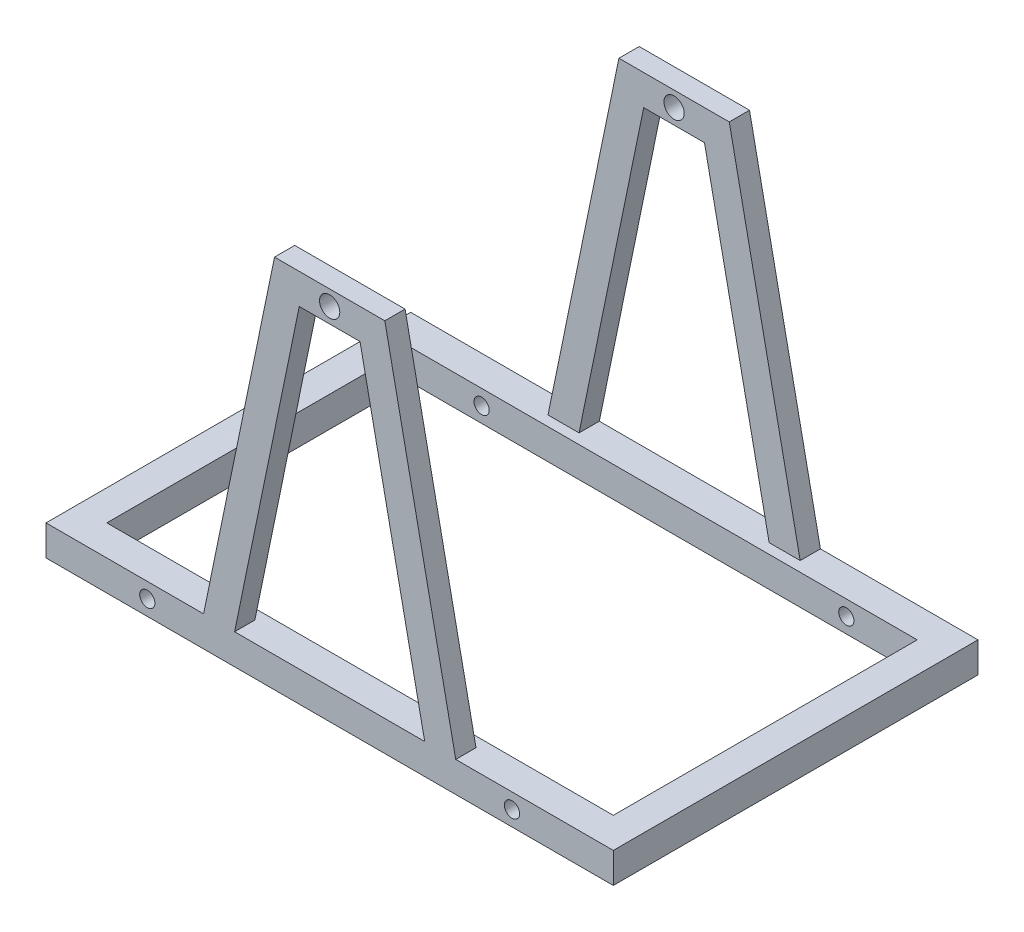
ISO-10303-21;
HEADER;
FILE_DESCRIPTION(('STEP AP214'),'2;1');
FILE_NAME('part.step','',(''),(''),'','','');
FILE_SCHEMA(('AUTOMOTIVE_DESIGN { 1 0 10303 214 1 1 1 1 }'));
ENDSEC;
DATA;
#1=APPLICATION_CONTEXT('core data for automotive mechanical design processes');
#2=APPLICATION_PROTOCOL_DEFINITION('international standard','automotive_design',2000,#1);
#3=PRODUCT_CONTEXT('',#1,'mechanical');
#4=PRODUCT('Part','Part','',(#3));
#5=PRODUCT_RELATED_PRODUCT_CATEGORY('part','',(#4));
#6=PRODUCT_DEFINITION_FORMATION('','',#4);
#7=PRODUCT_DEFINITION_CONTEXT('part definition',#1,'design');
#8=PRODUCT_DEFINITION('design','',#6,#7);
#9=PRODUCT_DEFINITION_SHAPE('','',#8);
#10=(LENGTH_UNIT() NAMED_UNIT(*) SI_UNIT(.MILLI.,.METRE.));
#11=(NAMED_UNIT(*) PLANE_ANGLE_UNIT() SI_UNIT($,.RADIAN.));
#12=(NAMED_UNIT(*) SI_UNIT($,.STERADIAN.) SOLID_ANGLE_UNIT());
#13=UNCERTAINTY_MEASURE_WITH_UNIT(LENGTH_MEASURE(1.E-05),#10,'distance_accuracy_value','');
#14=(GEOMETRIC_REPRESENTATION_CONTEXT(3) GLOBAL_UNCERTAINTY_ASSIGNED_CONTEXT((#13)) GLOBAL_UNIT_ASSIGNED_CONTEXT((#10,
#11,#12)) REPRESENTATION_CONTEXT('',''));
#15=CARTESIAN_POINT('',(0.,0.,0.));
#16=DIRECTION('',(0.,0.,1.));
#17=DIRECTION('',(1.,0.,0.));
#18=AXIS2_PLACEMENT_3D('',#15,#16,#17);
#19=CARTESIAN_POINT('',(0.,30.,0.));
#20=DIRECTION('',(0.,1.,0.));
#21=DIRECTION('',(0.,0.,1.));
#22=AXIS2_PLACEMENT_3D('',#19,#20,#21);
#23=PLANE('',#22);
#24=DIRECTION('',(1.,0.,0.));
#25=VECTOR('',#24,1.);
#26=CARTESIAN_POINT('',(250.,30.,150.));
#27=LINE('',#26,#25);
#28=CARTESIAN_POINT('',(-250.,30.,150.));
#29=VERTEX_POINT('',#28);
#30=CARTESIAN_POINT('',(250.,30.,150.));
#31=VERTEX_POINT('',#30);
#32=EDGE_CURVE('E430',#29,#31,#27,.T.);
#33=ORIENTED_EDGE('',*,*,#32,.F.);
#34=DIRECTION('',(0.,0.,1.));
#35=VECTOR('',#34,1.);
#36=CARTESIAN_POINT('',(-250.,30.,-150.));
#37=LINE('',#36,#35);
#38=CARTESIAN_POINT('',(-250.,30.,-150.));
#39=VERTEX_POINT('',#38);
#40=EDGE_CURVE('E427',#39,#29,#37,.T.);
#41=ORIENTED_EDGE('',*,*,#40,.F.);
#42=DIRECTION('',(-1.,0.,0.));
#43=VECTOR('',#42,1.);
#44=CARTESIAN_POINT('',(250.,30.,-150.));
#45=LINE('',#44,#43);
#46=CARTESIAN_POINT('',(250.,30.,-150.));
#47=VERTEX_POINT('',#46);
#48=EDGE_CURVE('E438',#47,#39,#45,.T.);
#49=ORIENTED_EDGE('',*,*,#48,.F.);
#50=DIRECTION('',(0.,0.,-1.));
#51=VECTOR('',#50,1.);
#52=CARTESIAN_POINT('',(250.,30.,-150.));
#53=LINE('',#52,#51);
#54=EDGE_CURVE('E434',#31,#47,#53,.T.);
#55=ORIENTED_EDGE('',*,*,#54,.F.);
#56=EDGE_LOOP('',(#33,#41,#49,#55));
#57=FACE_BOUND('',#56,.T.);
#58=DIRECTION('',(1.,0.,0.));
#59=VECTOR('',#58,1.);
#60=CARTESIAN_POINT('',(0.,30.,-160.));
#61=LINE('',#60,#59);
#62=CARTESIAN_POINT('',(-124.452744043017,30.,-160.));
#63=VERTEX_POINT('',#62);
#64=CARTESIAN_POINT('',(-93.8235294117647,30.,-160.));
#65=VERTEX_POINT('',#64);
#66=EDGE_CURVE('E91',#63,#65,#61,.T.);
#67=ORIENTED_EDGE('',*,*,#66,.F.);
#68=DIRECTION('',(0.,0.,-1.));
#69=VECTOR('',#68,1.);
#70=CARTESIAN_POINT('',(-124.452744043017,30.,0.));
#71=LINE('',#70,#69);
#72=CARTESIAN_POINT('',(-124.452744043017,30.,-180.));
#73=VERTEX_POINT('',#72);
#74=EDGE_CURVE('E258',#63,#73,#71,.T.);
#75=ORIENTED_EDGE('',*,*,#74,.T.);
#76=DIRECTION('',(-1.,0.,0.));
#77=VECTOR('',#76,1.);
#78=CARTESIAN_POINT('',(0.,30.,-180.));
#79=LINE('',#78,#77);
#80=CARTESIAN_POINT('',(-280.,30.,-180.));
#81=VERTEX_POINT('',#80);
#82=EDGE_CURVE('E483',#73,#81,#79,.T.);
#83=ORIENTED_EDGE('',*,*,#82,.T.);
#84=DIRECTION('',(0.,0.,1.));
#85=VECTOR('',#84,1.);
#86=CARTESIAN_POINT('',(-280.,30.,0.));
#87=LINE('',#86,#85);
#88=CARTESIAN_POINT('',(-280.,30.,180.));
#89=VERTEX_POINT('',#88);
#90=EDGE_CURVE('E470',#81,#89,#87,.T.);
#91=ORIENTED_EDGE('',*,*,#90,.T.);
#92=DIRECTION('',(1.,0.,0.));
#93=VECTOR('',#92,1.);
#94=CARTESIAN_POINT('',(0.,30.,180.));
#95=LINE('',#94,#93);
#96=CARTESIAN_POINT('',(-124.452744043017,30.,180.));
#97=VERTEX_POINT('',#96);
#98=EDGE_CURVE('E476',#89,#97,#95,.T.);
#99=ORIENTED_EDGE('',*,*,#98,.T.);
#100=DIRECTION('',(0.,0.,1.));
#101=VECTOR('',#100,1.);
#102=CARTESIAN_POINT('',(-124.452744043017,30.,0.));
#103=LINE('',#102,#101);
#104=CARTESIAN_POINT('',(-124.452744043017,30.,160.));
#105=VERTEX_POINT('',#104);
#106=EDGE_CURVE('E391',#105,#97,#103,.T.);
#107=ORIENTED_EDGE('',*,*,#106,.F.);
#108=DIRECTION('',(-1.,0.,0.));
#109=VECTOR('',#108,1.);
#110=CARTESIAN_POINT('',(0.,30.,160.));
#111=LINE('',#110,#109);
#112=CARTESIAN_POINT('',(-93.8235294117647,30.,160.));
#113=VERTEX_POINT('',#112);
#114=EDGE_CURVE('E395',#113,#105,#111,.T.);
#115=ORIENTED_EDGE('',*,*,#114,.F.);
#116=DIRECTION('',(0.,0.,1.));
#117=VECTOR('',#116,1.);
#118=CARTESIAN_POINT('',(-93.8235294117647,30.,0.));
#119=LINE('',#118,#117);
#120=CARTESIAN_POINT('',(-93.8235294117647,30.,180.));
#121=VERTEX_POINT('',#120);
#122=EDGE_CURVE('E369',#113,#121,#119,.T.);
#123=ORIENTED_EDGE('',*,*,#122,.T.);
#124=CARTESIAN_POINT('',(93.8235294117647,30.,180.));
#125=VERTEX_POINT('',#124);
#126=EDGE_CURVE('E480',#121,#125,#95,.T.);
#127=ORIENTED_EDGE('',*,*,#126,.T.);
#128=DIRECTION('',(0.,0.,-1.));
#129=VECTOR('',#128,1.);
#130=CARTESIAN_POINT('',(93.8235294117647,30.,0.));
#131=LINE('',#130,#129);
#132=CARTESIAN_POINT('',(93.8235294117647,30.,160.));
#133=VERTEX_POINT('',#132);
#134=EDGE_CURVE('E384',#125,#133,#131,.T.);
#135=ORIENTED_EDGE('',*,*,#134,.T.);
#136=CARTESIAN_POINT('',(124.452744043017,30.,160.));
#137=VERTEX_POINT('',#136);
#138=EDGE_CURVE('E399',#137,#133,#111,.T.);
#139=ORIENTED_EDGE('',*,*,#138,.F.);
#140=DIRECTION('',(0.,0.,-1.));
#141=VECTOR('',#140,1.);
#142=CARTESIAN_POINT('',(124.452744043017,30.,0.));
#143=LINE('',#142,#141);
#144=CARTESIAN_POINT('',(124.452744043017,30.,180.));
#145=VERTEX_POINT('',#144);
#146=EDGE_CURVE('E387',#145,#137,#143,.T.);
#147=ORIENTED_EDGE('',*,*,#146,.F.);
#148=CARTESIAN_POINT('',(280.,30.,180.));
#149=VERTEX_POINT('',#148);
#150=EDGE_CURVE('E474',#145,#149,#95,.T.);
#151=ORIENTED_EDGE('',*,*,#150,.T.);
#152=DIRECTION('',(0.,0.,-1.));
#153=VECTOR('',#152,1.);
#154=CARTESIAN_POINT('',(280.,30.,0.));
#155=LINE('',#154,#153);
#156=CARTESIAN_POINT('',(280.,30.,-180.));
#157=VERTEX_POINT('',#156);
#158=EDGE_CURVE('E479',#149,#157,#155,.T.);
#159=ORIENTED_EDGE('',*,*,#158,.T.);
#160=CARTESIAN_POINT('',(124.452744043017,30.,-180.));
#161=VERTEX_POINT('',#160);
#162=EDGE_CURVE('E484',#157,#161,#79,.T.);
#163=ORIENTED_EDGE('',*,*,#162,.T.);
#164=DIRECTION('',(0.,0.,1.));
#165=VECTOR('',#164,1.);
#166=CARTESIAN_POINT('',(124.452744043017,30.,0.));
#167=LINE('',#166,#165);
#168=CARTESIAN_POINT('',(124.452744043017,30.,-160.));
#169=VERTEX_POINT('',#168);
#170=EDGE_CURVE('E298',#161,#169,#167,.T.);
#171=ORIENTED_EDGE('',*,*,#170,.T.);
#172=CARTESIAN_POINT('',(93.8235294117647,30.,-160.));
#173=VERTEX_POINT('',#172);
#174=EDGE_CURVE('E315',#173,#169,#61,.T.);
#175=ORIENTED_EDGE('',*,*,#174,.F.);
#176=DIRECTION('',(0.,0.,1.));
#177=VECTOR('',#176,1.);
#178=CARTESIAN_POINT('',(93.8235294117647,30.,0.));
#179=LINE('',#178,#177);
#180=CARTESIAN_POINT('',(93.8235294117647,30.,-180.));
#181=VERTEX_POINT('',#180);
#182=EDGE_CURVE('E307',#181,#173,#179,.T.);
#183=ORIENTED_EDGE('',*,*,#182,.F.);
#184=CARTESIAN_POINT('',(-93.8235294117647,30.,-180.));
#185=VERTEX_POINT('',#184);
#186=EDGE_CURVE('E488',#181,#185,#79,.T.);
#187=ORIENTED_EDGE('',*,*,#186,.T.);
#188=DIRECTION('',(0.,0.,-1.));
#189=VECTOR('',#188,1.);
#190=CARTESIAN_POINT('',(-93.8235294117647,30.,0.));
#191=LINE('',#190,#189);
#192=EDGE_CURVE('E87',#65,#185,#191,.T.);
#193=ORIENTED_EDGE('',*,*,#192,.F.);
#194=EDGE_LOOP('',(#67,#75,#83,#91,#99,#107,#115,#123,#127,#135,#139,#147,#151,#159,#163,#171,
#175,#183,#187,#193));
#195=FACE_BOUND('',#194,.T.);
#196=ADVANCED_FACE('F69',(#57,#195),#23,.T.);
#197=CARTESIAN_POINT('',(0.,0.,0.));
#198=DIRECTION('',(0.,1.,0.));
#199=DIRECTION('',(0.,0.,1.));
#200=AXIS2_PLACEMENT_3D('',#197,#198,#199);
#201=PLANE('',#200);
#202=DIRECTION('',(0.,0.,1.));
#203=VECTOR('',#202,1.);
#204=CARTESIAN_POINT('',(-280.,0.,0.));
#205=LINE('',#204,#203);
#206=CARTESIAN_POINT('',(-280.,0.,-180.));
#207=VERTEX_POINT('',#206);
#208=CARTESIAN_POINT('',(-280.,0.,180.));
#209=VERTEX_POINT('',#208);
#210=EDGE_CURVE('E469',#207,#209,#205,.T.);
#211=ORIENTED_EDGE('',*,*,#210,.F.);
#212=DIRECTION('',(-1.,0.,0.));
#213=VECTOR('',#212,1.);
#214=CARTESIAN_POINT('',(0.,0.,-180.));
#215=LINE('',#214,#213);
#216=CARTESIAN_POINT('',(280.,0.,-180.));
#217=VERTEX_POINT('',#216);
#218=EDGE_CURVE('E475',#217,#207,#215,.T.);
#219=ORIENTED_EDGE('',*,*,#218,.F.);
#220=DIRECTION('',(0.,0.,-1.));
#221=VECTOR('',#220,1.);
#222=CARTESIAN_POINT('',(280.,0.,0.));
#223=LINE('',#222,#221);
#224=CARTESIAN_POINT('',(280.,0.,180.));
#225=VERTEX_POINT('',#224);
#226=EDGE_CURVE('E495',#225,#217,#223,.T.);
#227=ORIENTED_EDGE('',*,*,#226,.F.);
#228=DIRECTION('',(1.,0.,0.));
#229=VECTOR('',#228,1.);
#230=CARTESIAN_POINT('',(0.,0.,180.));
#231=LINE('',#230,#229);
#232=EDGE_CURVE('E492',#209,#225,#231,.T.);
#233=ORIENTED_EDGE('',*,*,#232,.F.);
#234=EDGE_LOOP('',(#211,#219,#227,#233));
#235=FACE_BOUND('',#234,.T.);
#236=DIRECTION('',(0.,0.,1.));
#237=VECTOR('',#236,1.);
#238=CARTESIAN_POINT('',(-250.,0.,-150.));
#239=LINE('',#238,#237);
#240=CARTESIAN_POINT('',(-250.,0.,-150.));
#241=VERTEX_POINT('',#240);
#242=CARTESIAN_POINT('',(-250.,0.,150.));
#243=VERTEX_POINT('',#242);
#244=EDGE_CURVE('E426',#241,#243,#239,.T.);
#245=ORIENTED_EDGE('',*,*,#244,.T.);
#246=DIRECTION('',(1.,0.,0.));
#247=VECTOR('',#246,1.);
#248=CARTESIAN_POINT('',(250.,0.,150.));
#249=LINE('',#248,#247);
#250=CARTESIAN_POINT('',(250.,0.,150.));
#251=VERTEX_POINT('',#250);
#252=EDGE_CURVE('E445',#243,#251,#249,.T.);
#253=ORIENTED_EDGE('',*,*,#252,.T.);
#254=DIRECTION('',(0.,0.,-1.));
#255=VECTOR('',#254,1.);
#256=CARTESIAN_POINT('',(250.,0.,-150.));
#257=LINE('',#256,#255);
#258=CARTESIAN_POINT('',(250.,0.,-150.));
#259=VERTEX_POINT('',#258);
#260=EDGE_CURVE('E449',#251,#259,#257,.T.);
#261=ORIENTED_EDGE('',*,*,#260,.T.);
#262=DIRECTION('',(-1.,0.,0.));
#263=VECTOR('',#262,1.);
#264=CARTESIAN_POINT('',(250.,0.,-150.));
#265=LINE('',#264,#263);
#266=EDGE_CURVE('E431',#259,#241,#265,.T.);
#267=ORIENTED_EDGE('',*,*,#266,.T.);
#268=EDGE_LOOP('',(#245,#253,#261,#267));
#269=FACE_BOUND('',#268,.T.);
#270=ADVANCED_FACE('F581',(#235,#269),#201,.F.);
#271=CARTESIAN_POINT('',(-280.,30.,0.));
#272=DIRECTION('',(1.,0.,0.));
#273=DIRECTION('',(0.,0.,-1.));
#274=AXIS2_PLACEMENT_3D('',#271,#272,#273);
#275=PLANE('',#274);
#276=ORIENTED_EDGE('',*,*,#210,.T.);
#277=DIRECTION('',(0.,-1.,0.));
#278=VECTOR('',#277,1.);
#279=CARTESIAN_POINT('',(-280.,30.,180.));
#280=LINE('',#279,#278);
#281=EDGE_CURVE('E12',#89,#209,#280,.T.);
#282=ORIENTED_EDGE('',*,*,#281,.F.);
#283=ORIENTED_EDGE('',*,*,#90,.F.);
#284=DIRECTION('',(0.,-1.,0.));
#285=VECTOR('',#284,1.);
#286=CARTESIAN_POINT('',(-280.,30.,-180.));
#287=LINE('',#286,#285);
#288=EDGE_CURVE('E487',#81,#207,#287,.T.);
#289=ORIENTED_EDGE('',*,*,#288,.T.);
#290=EDGE_LOOP('',(#276,#282,#283,#289));
#291=FACE_BOUND('',#290,.T.);
#292=ADVANCED_FACE('F71',(#291),#275,.F.);
#293=CARTESIAN_POINT('',(0.,30.,180.));
#294=DIRECTION('',(0.,0.,-1.));
#295=DIRECTION('',(-1.,0.,0.));
#296=AXIS2_PLACEMENT_3D('',#293,#294,#295);
#297=PLANE('',#296);
#298=CARTESIAN_POINT('',(0.,355.,180.));
#299=DIRECTION('',(0.,0.,1.));
#300=DIRECTION('',(1.,0.,0.));
#301=AXIS2_PLACEMENT_3D('',#298,#299,#300);
#302=CIRCLE('',#301,10.);
#303=CARTESIAN_POINT('',(10.,355.,180.));
#304=VERTEX_POINT('',#303);
#305=EDGE_CURVE('E318',#304,#304,#302,.T.);
#306=ORIENTED_EDGE('',*,*,#305,.F.);
#307=EDGE_LOOP('',(#306));
#308=FACE_BOUND('',#307,.T.);
#309=ORIENTED_EDGE('',*,*,#150,.F.);
#310=DIRECTION('',(-0.201652920670487,0.979457043256652,0.));
#311=VECTOR('',#310,1.);
#312=CARTESIAN_POINT('',(129.3837112977,6.04958762011461,180.));
#313=LINE('',#312,#311);
#314=CARTESIAN_POINT('',(54.4527440430173,370.,180.));
#315=VERTEX_POINT('',#314);
#316=EDGE_CURVE('E360',#145,#315,#313,.T.);
#317=ORIENTED_EDGE('',*,*,#316,.T.);
#318=DIRECTION('',(1.,0.,0.));
#319=VECTOR('',#318,1.);
#320=CARTESIAN_POINT('',(-30.,370.,180.));
#321=LINE('',#320,#319);
#322=CARTESIAN_POINT('',(-54.4527440430172,370.,180.));
#323=VERTEX_POINT('',#322);
#324=EDGE_CURVE('E328',#315,#323,#321,.F.);
#325=ORIENTED_EDGE('',*,*,#324,.T.);
#326=DIRECTION('',(-0.201652920670487,-0.979457043256652,0.));
#327=VECTOR('',#326,1.);
#328=CARTESIAN_POINT('',(-129.3837112977,6.04958762011461,180.));
#329=LINE('',#328,#327);
#330=EDGE_CURVE('E346',#323,#97,#329,.T.);
#331=ORIENTED_EDGE('',*,*,#330,.T.);
#332=ORIENTED_EDGE('',*,*,#98,.F.);
#333=ORIENTED_EDGE('',*,*,#281,.T.);
#334=ORIENTED_EDGE('',*,*,#232,.T.);
#335=DIRECTION('',(0.,-1.,0.));
#336=VECTOR('',#335,1.);
#337=CARTESIAN_POINT('',(280.,30.,180.));
#338=LINE('',#337,#336);
#339=EDGE_CURVE('E79',#149,#225,#338,.T.);
#340=ORIENTED_EDGE('',*,*,#339,.F.);
#341=EDGE_LOOP('',(#309,#317,#325,#331,#332,#333,#334,#340));
#342=FACE_BOUND('',#341,.T.);
#343=ORIENTED_EDGE('',*,*,#126,.F.);
#344=DIRECTION('',(-0.201652920670487,-0.979457043256652,0.));
#345=VECTOR('',#344,1.);
#346=CARTESIAN_POINT('',(-100.,0.,180.));
#347=LINE('',#346,#345);
#348=CARTESIAN_POINT('',(-30.,340.,180.));
#349=VERTEX_POINT('',#348);
#350=EDGE_CURVE('E350',#349,#121,#347,.T.);
#351=ORIENTED_EDGE('',*,*,#350,.F.);
#352=DIRECTION('',(-1.,0.,0.));
#353=VECTOR('',#352,1.);
#354=CARTESIAN_POINT('',(-30.,340.,180.));
#355=LINE('',#354,#353);
#356=CARTESIAN_POINT('',(30.,340.,180.));
#357=VERTEX_POINT('',#356);
#358=EDGE_CURVE('E354',#357,#349,#355,.T.);
#359=ORIENTED_EDGE('',*,*,#358,.F.);
#360=DIRECTION('',(-0.201652920670487,0.979457043256652,0.));
#361=VECTOR('',#360,1.);
#362=CARTESIAN_POINT('',(100.,0.,180.));
#363=LINE('',#362,#361);
#364=EDGE_CURVE('E357',#125,#357,#363,.T.);
#365=ORIENTED_EDGE('',*,*,#364,.F.);
#366=EDGE_LOOP('',(#343,#351,#359,#365));
#367=FACE_BOUND('',#366,.T.);
#368=CARTESIAN_POINT('',(-180.,15.,180.));
#369=DIRECTION('',(0.,0.,1.));
#370=DIRECTION('',(1.,0.,0.));
#371=AXIS2_PLACEMENT_3D('',#368,#369,#370);
#372=CIRCLE('',#371,7.50000000000001);
#373=CARTESIAN_POINT('',(-172.5,15.,180.));
#374=VERTEX_POINT('',#373);
#375=EDGE_CURVE('E405',#374,#374,#372,.T.);
#376=ORIENTED_EDGE('',*,*,#375,.F.);
#377=EDGE_LOOP('',(#376));
#378=FACE_BOUND('',#377,.T.);
#379=CARTESIAN_POINT('',(180.,15.0000000000001,180.));
#380=DIRECTION('',(0.,0.,1.));
#381=DIRECTION('',(-1.,0.,0.));
#382=AXIS2_PLACEMENT_3D('',#379,#380,#381);
#383=CIRCLE('',#382,7.50000000000001);
#384=CARTESIAN_POINT('',(172.5,15.0000000000001,180.));
#385=VERTEX_POINT('',#384);
#386=EDGE_CURVE('E409',#385,#385,#383,.T.);
#387=ORIENTED_EDGE('',*,*,#386,.F.);
#388=EDGE_LOOP('',(#387));
#389=FACE_BOUND('',#388,.T.);
#390=ADVANCED_FACE('F542',(#308,#342,#367,#378,#389),#297,.F.);
#391=CARTESIAN_POINT('',(280.,30.,0.));
#392=DIRECTION('',(-1.,0.,0.));
#393=DIRECTION('',(0.,0.,1.));
#394=AXIS2_PLACEMENT_3D('',#391,#392,#393);
#395=PLANE('',#394);
#396=ORIENTED_EDGE('',*,*,#226,.T.);
#397=DIRECTION('',(0.,-1.,0.));
#398=VECTOR('',#397,1.);
#399=CARTESIAN_POINT('',(280.,30.,-180.));
#400=LINE('',#399,#398);
#401=EDGE_CURVE('E503',#157,#217,#400,.T.);
#402=ORIENTED_EDGE('',*,*,#401,.F.);
#403=ORIENTED_EDGE('',*,*,#158,.F.);
#404=ORIENTED_EDGE('',*,*,#339,.T.);
#405=EDGE_LOOP('',(#396,#402,#403,#404));
#406=FACE_BOUND('',#405,.T.);
#407=ADVANCED_FACE('F596',(#406),#395,.F.);
#408=CARTESIAN_POINT('',(0.,30.,-180.));
#409=DIRECTION('',(0.,0.,1.));
#410=DIRECTION('',(1.,0.,0.));
#411=AXIS2_PLACEMENT_3D('',#408,#409,#410);
#412=PLANE('',#411);
#413=CARTESIAN_POINT('',(0.,355.,-180.));
#414=DIRECTION('',(0.,0.,1.));
#415=DIRECTION('',(1.,0.,0.));
#416=AXIS2_PLACEMENT_3D('',#413,#414,#415);
#417=CIRCLE('',#416,10.);
#418=CARTESIAN_POINT('',(10.,355.,-180.));
#419=VERTEX_POINT('',#418);
#420=EDGE_CURVE('E267',#419,#419,#417,.T.);
#421=ORIENTED_EDGE('',*,*,#420,.T.);
#422=EDGE_LOOP('',(#421));
#423=FACE_BOUND('',#422,.T.);
#424=ORIENTED_EDGE('',*,*,#82,.F.);
#425=DIRECTION('',(-0.201652920670487,-0.979457043256652,0.));
#426=VECTOR('',#425,1.);
#427=CARTESIAN_POINT('',(-129.3837112977,6.04958762011461,-180.));
#428=LINE('',#427,#426);
#429=CARTESIAN_POINT('',(-54.4527440430172,370.,-180.));
#430=VERTEX_POINT('',#429);
#431=EDGE_CURVE('E281',#430,#73,#428,.T.);
#432=ORIENTED_EDGE('',*,*,#431,.F.);
#433=DIRECTION('',(1.,0.,0.));
#434=VECTOR('',#433,1.);
#435=CARTESIAN_POINT('',(-30.,370.,-180.));
#436=LINE('',#435,#434);
#437=CARTESIAN_POINT('',(54.4527440430173,370.,-180.));
#438=VERTEX_POINT('',#437);
#439=EDGE_CURVE('E249',#438,#430,#436,.F.);
#440=ORIENTED_EDGE('',*,*,#439,.F.);
#441=DIRECTION('',(-0.201652920670487,0.979457043256652,0.));
#442=VECTOR('',#441,1.);
#443=CARTESIAN_POINT('',(129.3837112977,6.04958762011461,-180.));
#444=LINE('',#443,#442);
#445=EDGE_CURVE('E286',#161,#438,#444,.T.);
#446=ORIENTED_EDGE('',*,*,#445,.F.);
#447=ORIENTED_EDGE('',*,*,#162,.F.);
#448=ORIENTED_EDGE('',*,*,#401,.T.);
#449=ORIENTED_EDGE('',*,*,#218,.T.);
#450=ORIENTED_EDGE('',*,*,#288,.F.);
#451=EDGE_LOOP('',(#424,#432,#440,#446,#447,#448,#449,#450));
#452=FACE_BOUND('',#451,.T.);
#453=DIRECTION('',(-0.201652920670487,-0.979457043256652,0.));
#454=VECTOR('',#453,1.);
#455=CARTESIAN_POINT('',(-100.,0.,-180.));
#456=LINE('',#455,#454);
#457=CARTESIAN_POINT('',(-30.,340.,-180.));
#458=VERTEX_POINT('',#457);
#459=EDGE_CURVE('E260',#458,#185,#456,.T.);
#460=ORIENTED_EDGE('',*,*,#459,.T.);
#461=ORIENTED_EDGE('',*,*,#186,.F.);
#462=DIRECTION('',(-0.201652920670487,0.979457043256652,0.));
#463=VECTOR('',#462,1.);
#464=CARTESIAN_POINT('',(100.,0.,-180.));
#465=LINE('',#464,#463);
#466=CARTESIAN_POINT('',(30.,340.,-180.));
#467=VERTEX_POINT('',#466);
#468=EDGE_CURVE('E289',#181,#467,#465,.T.);
#469=ORIENTED_EDGE('',*,*,#468,.T.);
#470=DIRECTION('',(-1.,0.,0.));
#471=VECTOR('',#470,1.);
#472=CARTESIAN_POINT('',(-30.,340.,-180.));
#473=LINE('',#472,#471);
#474=EDGE_CURVE('E264',#467,#458,#473,.T.);
#475=ORIENTED_EDGE('',*,*,#474,.T.);
#476=EDGE_LOOP('',(#460,#461,#469,#475));
#477=FACE_BOUND('',#476,.T.);
#478=CARTESIAN_POINT('',(180.,15.0000000000001,-180.));
#479=DIRECTION('',(0.,0.,1.));
#480=DIRECTION('',(-1.,0.,0.));
#481=AXIS2_PLACEMENT_3D('',#478,#479,#480);
#482=CIRCLE('',#481,7.50000000000001);
#483=CARTESIAN_POINT('',(172.5,15.0000000000001,-180.));
#484=VERTEX_POINT('',#483);
#485=EDGE_CURVE('E413',#484,#484,#482,.T.);
#486=ORIENTED_EDGE('',*,*,#485,.T.);
#487=EDGE_LOOP('',(#486));
#488=FACE_BOUND('',#487,.T.);
#489=CARTESIAN_POINT('',(-180.,15.,-180.));
#490=DIRECTION('',(0.,0.,1.));
#491=DIRECTION('',(1.,0.,0.));
#492=AXIS2_PLACEMENT_3D('',#489,#490,#491);
#493=CIRCLE('',#492,7.50000000000001);
#494=CARTESIAN_POINT('',(-172.5,15.,-180.));
#495=VERTEX_POINT('',#494);
#496=EDGE_CURVE('E400',#495,#495,#493,.T.);
#497=ORIENTED_EDGE('',*,*,#496,.T.);
#498=EDGE_LOOP('',(#497));
#499=FACE_BOUND('',#498,.T.);
#500=ADVANCED_FACE('F559',(#423,#452,#477,#488,#499),#412,.F.);
#501=CARTESIAN_POINT('',(-250.,30.,-150.));
#502=DIRECTION('',(1.,0.,0.));
#503=DIRECTION('',(0.,0.,-1.));
#504=AXIS2_PLACEMENT_3D('',#501,#502,#503);
#505=PLANE('',#504);
#506=ORIENTED_EDGE('',*,*,#244,.F.);
#507=DIRECTION('',(0.,-1.,0.));
#508=VECTOR('',#507,1.);
#509=CARTESIAN_POINT('',(-250.,30.,-150.));
#510=LINE('',#509,#508);
#511=EDGE_CURVE('E441',#39,#241,#510,.T.);
#512=ORIENTED_EDGE('',*,*,#511,.F.);
#513=ORIENTED_EDGE('',*,*,#40,.T.);
#514=DIRECTION('',(0.,-1.,0.));
#515=VECTOR('',#514,1.);
#516=CARTESIAN_POINT('',(-250.,30.,150.));
#517=LINE('',#516,#515);
#518=EDGE_CURVE('E465',#29,#243,#517,.T.);
#519=ORIENTED_EDGE('',*,*,#518,.T.);
#520=EDGE_LOOP('',(#506,#512,#513,#519));
#521=FACE_BOUND('',#520,.T.);
#522=ADVANCED_FACE('F591',(#521),#505,.T.);
#523=CARTESIAN_POINT('',(250.,30.,150.));
#524=DIRECTION('',(0.,0.,-1.));
#525=DIRECTION('',(-1.,0.,0.));
#526=AXIS2_PLACEMENT_3D('',#523,#524,#525);
#527=PLANE('',#526);
#528=CARTESIAN_POINT('',(-180.,15.,150.));
#529=DIRECTION('',(0.,0.,-1.));
#530=DIRECTION('',(-1.,0.,0.));
#531=AXIS2_PLACEMENT_3D('',#528,#529,#530);
#532=CIRCLE('',#531,7.50000000000001);
#533=CARTESIAN_POINT('',(-187.5,15.,150.));
#534=VERTEX_POINT('',#533);
#535=EDGE_CURVE('E422',#534,#534,#532,.T.);
#536=ORIENTED_EDGE('',*,*,#535,.F.);
#537=EDGE_LOOP('',(#536));
#538=FACE_BOUND('',#537,.T.);
#539=CARTESIAN_POINT('',(180.,15.0000000000001,150.));
#540=DIRECTION('',(0.,0.,-1.));
#541=DIRECTION('',(-1.,0.,0.));
#542=AXIS2_PLACEMENT_3D('',#539,#540,#541);
#543=CIRCLE('',#542,7.50000000000001);
#544=CARTESIAN_POINT('',(172.5,15.0000000000001,150.));
#545=VERTEX_POINT('',#544);
#546=EDGE_CURVE('E417',#545,#545,#543,.T.);
#547=ORIENTED_EDGE('',*,*,#546,.F.);
#548=EDGE_LOOP('',(#547));
#549=FACE_BOUND('',#548,.T.);
#550=ORIENTED_EDGE('',*,*,#252,.F.);
#551=ORIENTED_EDGE('',*,*,#518,.F.);
#552=ORIENTED_EDGE('',*,*,#32,.T.);
#553=DIRECTION('',(0.,-1.,0.));
#554=VECTOR('',#553,1.);
#555=CARTESIAN_POINT('',(250.,30.,150.));
#556=LINE('',#555,#554);
#557=EDGE_CURVE('E462',#31,#251,#556,.T.);
#558=ORIENTED_EDGE('',*,*,#557,.T.);
#559=EDGE_LOOP('',(#550,#551,#552,#558));
#560=FACE_BOUND('',#559,.T.);
#561=ADVANCED_FACE('F650',(#538,#549,#560),#527,.T.);
#562=CARTESIAN_POINT('',(250.,30.,-150.));
#563=DIRECTION('',(-1.,0.,0.));
#564=DIRECTION('',(0.,0.,1.));
#565=AXIS2_PLACEMENT_3D('',#562,#563,#564);
#566=PLANE('',#565);
#567=ORIENTED_EDGE('',*,*,#260,.F.);
#568=ORIENTED_EDGE('',*,*,#557,.F.);
#569=ORIENTED_EDGE('',*,*,#54,.T.);
#570=DIRECTION('',(0.,-1.,0.));
#571=VECTOR('',#570,1.);
#572=CARTESIAN_POINT('',(250.,30.,-150.));
#573=LINE('',#572,#571);
#574=EDGE_CURVE('E459',#47,#259,#573,.T.);
#575=ORIENTED_EDGE('',*,*,#574,.T.);
#576=EDGE_LOOP('',(#567,#568,#569,#575));
#577=FACE_BOUND('',#576,.T.);
#578=ADVANCED_FACE('F647',(#577),#566,.T.);
#579=CARTESIAN_POINT('',(250.,30.,-150.));
#580=DIRECTION('',(0.,0.,1.));
#581=DIRECTION('',(1.,0.,0.));
#582=AXIS2_PLACEMENT_3D('',#579,#580,#581);
#583=PLANE('',#582);
#584=CARTESIAN_POINT('',(-180.,15.,-150.));
#585=DIRECTION('',(0.,0.,1.));
#586=DIRECTION('',(1.,0.,0.));
#587=AXIS2_PLACEMENT_3D('',#584,#585,#586);
#588=CIRCLE('',#587,7.50000000000001);
#589=CARTESIAN_POINT('',(-172.5,15.,-150.));
#590=VERTEX_POINT('',#589);
#591=EDGE_CURVE('E421',#590,#590,#588,.T.);
#592=ORIENTED_EDGE('',*,*,#591,.F.);
#593=EDGE_LOOP('',(#592));
#594=FACE_BOUND('',#593,.T.);
#595=CARTESIAN_POINT('',(180.,15.0000000000001,-150.));
#596=DIRECTION('',(0.,0.,1.));
#597=DIRECTION('',(1.,0.,0.));
#598=AXIS2_PLACEMENT_3D('',#595,#596,#597);
#599=CIRCLE('',#598,7.50000000000001);
#600=CARTESIAN_POINT('',(187.5,15.0000000000001,-150.));
#601=VERTEX_POINT('',#600);
#602=EDGE_CURVE('E404',#601,#601,#599,.T.);
#603=ORIENTED_EDGE('',*,*,#602,.F.);
#604=EDGE_LOOP('',(#603));
#605=FACE_BOUND('',#604,.T.);
#606=ORIENTED_EDGE('',*,*,#266,.F.);
#607=ORIENTED_EDGE('',*,*,#574,.F.);
#608=ORIENTED_EDGE('',*,*,#48,.T.);
#609=ORIENTED_EDGE('',*,*,#511,.T.);
#610=EDGE_LOOP('',(#606,#607,#608,#609));
#611=FACE_BOUND('',#610,.T.);
#612=ADVANCED_FACE('F643',(#594,#605,#611),#583,.T.);
#613=CARTESIAN_POINT('',(180.,15.0000000000001,-180.));
#614=DIRECTION('',(0.,0.,1.));
#615=DIRECTION('',(1.,0.,0.));
#616=AXIS2_PLACEMENT_3D('',#613,#614,#615);
#617=CYLINDRICAL_SURFACE('',#616,7.50000000000001);
#618=ORIENTED_EDGE('',*,*,#602,.T.);
#619=EDGE_LOOP('',(#618));
#620=FACE_BOUND('',#619,.T.);
#621=ORIENTED_EDGE('',*,*,#485,.F.);
#622=EDGE_LOOP('',(#621));
#623=FACE_BOUND('',#622,.T.);
#624=ADVANCED_FACE('F639',(#620,#623),#617,.F.);
#625=CARTESIAN_POINT('',(-180.,15.,-180.));
#626=DIRECTION('',(0.,0.,1.));
#627=DIRECTION('',(1.,0.,0.));
#628=AXIS2_PLACEMENT_3D('',#625,#626,#627);
#629=CYLINDRICAL_SURFACE('',#628,7.50000000000001);
#630=ORIENTED_EDGE('',*,*,#591,.T.);
#631=EDGE_LOOP('',(#630));
#632=FACE_BOUND('',#631,.T.);
#633=ORIENTED_EDGE('',*,*,#496,.F.);
#634=EDGE_LOOP('',(#633));
#635=FACE_BOUND('',#634,.T.);
#636=ADVANCED_FACE('F635',(#632,#635),#629,.F.);
#637=ORIENTED_EDGE('',*,*,#546,.T.);
#638=EDGE_LOOP('',(#637));
#639=FACE_BOUND('',#638,.T.);
#640=ORIENTED_EDGE('',*,*,#386,.T.);
#641=EDGE_LOOP('',(#640));
#642=FACE_BOUND('',#641,.T.);
#643=ADVANCED_FACE('F638',(#639,#642),#617,.F.);
#644=ORIENTED_EDGE('',*,*,#535,.T.);
#645=EDGE_LOOP('',(#644));
#646=FACE_BOUND('',#645,.T.);
#647=ORIENTED_EDGE('',*,*,#375,.T.);
#648=EDGE_LOOP('',(#647));
#649=FACE_BOUND('',#648,.T.);
#650=ADVANCED_FACE('F633',(#646,#649),#629,.F.);
#651=CARTESIAN_POINT('',(-129.3837112977,6.04958762011461,160.));
#652=DIRECTION('',(-0.979457043256651,0.201652920670487,0.));
#653=DIRECTION('',(-0.201652920670487,-0.979457043256652,0.));
#654=AXIS2_PLACEMENT_3D('',#651,#652,#653);
#655=PLANE('',#654);
#656=DIRECTION('',(-0.201652920670487,-0.979457043256652,0.));
#657=VECTOR('',#656,1.);
#658=CARTESIAN_POINT('',(-129.3837112977,6.04958762011461,160.));
#659=LINE('',#658,#657);
#660=CARTESIAN_POINT('',(-54.4527440430172,370.,160.));
#661=VERTEX_POINT('',#660);
#662=EDGE_CURVE('E323',#661,#105,#659,.T.);
#663=ORIENTED_EDGE('',*,*,#662,.T.);
#664=ORIENTED_EDGE('',*,*,#106,.T.);
#665=ORIENTED_EDGE('',*,*,#330,.F.);
#666=DIRECTION('',(0.,0.,1.));
#667=VECTOR('',#666,1.);
#668=CARTESIAN_POINT('',(-54.4527440430172,370.,160.));
#669=LINE('',#668,#667);
#670=EDGE_CURVE('E366',#661,#323,#669,.T.);
#671=ORIENTED_EDGE('',*,*,#670,.F.);
#672=EDGE_LOOP('',(#663,#664,#665,#671));
#673=FACE_BOUND('',#672,.T.);
#674=ADVANCED_FACE('F617',(#673),#655,.T.);
#675=CARTESIAN_POINT('',(-30.,370.,160.));
#676=DIRECTION('',(0.,1.,0.));
#677=DIRECTION('',(0.,0.,1.));
#678=AXIS2_PLACEMENT_3D('',#675,#676,#677);
#679=PLANE('',#678);
#680=ORIENTED_EDGE('',*,*,#324,.F.);
#681=DIRECTION('',(0.,0.,1.));
#682=VECTOR('',#681,1.);
#683=CARTESIAN_POINT('',(54.4527440430173,370.,160.));
#684=LINE('',#683,#682);
#685=CARTESIAN_POINT('',(54.4527440430173,370.,160.));
#686=VERTEX_POINT('',#685);
#687=EDGE_CURVE('E370',#686,#315,#684,.T.);
#688=ORIENTED_EDGE('',*,*,#687,.F.);
#689=DIRECTION('',(1.,0.,0.));
#690=VECTOR('',#689,1.);
#691=CARTESIAN_POINT('',(-30.,370.,160.));
#692=LINE('',#691,#690);
#693=EDGE_CURVE('E341',#686,#661,#692,.F.);
#694=ORIENTED_EDGE('',*,*,#693,.T.);
#695=ORIENTED_EDGE('',*,*,#670,.T.);
#696=EDGE_LOOP('',(#680,#688,#694,#695));
#697=FACE_BOUND('',#696,.T.);
#698=ADVANCED_FACE('F539',(#697),#679,.T.);
#699=CARTESIAN_POINT('',(129.3837112977,6.04958762011461,160.));
#700=DIRECTION('',(0.979457043256652,0.201652920670487,0.));
#701=DIRECTION('',(-0.201652920670487,0.979457043256652,0.));
#702=AXIS2_PLACEMENT_3D('',#699,#700,#701);
#703=PLANE('',#702);
#704=ORIENTED_EDGE('',*,*,#316,.F.);
#705=ORIENTED_EDGE('',*,*,#146,.T.);
#706=DIRECTION('',(-0.201652920670487,0.979457043256652,0.));
#707=VECTOR('',#706,1.);
#708=CARTESIAN_POINT('',(129.3837112977,6.04958762011461,160.));
#709=LINE('',#708,#707);
#710=EDGE_CURVE('E338',#137,#686,#709,.T.);
#711=ORIENTED_EDGE('',*,*,#710,.T.);
#712=ORIENTED_EDGE('',*,*,#687,.T.);
#713=EDGE_LOOP('',(#704,#705,#711,#712));
#714=FACE_BOUND('',#713,.T.);
#715=ADVANCED_FACE('F535',(#714),#703,.T.);
#716=CARTESIAN_POINT('',(100.,0.,160.));
#717=DIRECTION('',(0.979457043256652,0.201652920670487,0.));
#718=DIRECTION('',(-0.201652920670487,0.979457043256652,0.));
#719=AXIS2_PLACEMENT_3D('',#716,#717,#718);
#720=PLANE('',#719);
#721=ORIENTED_EDGE('',*,*,#134,.F.);
#722=ORIENTED_EDGE('',*,*,#364,.T.);
#723=DIRECTION('',(0.,0.,1.));
#724=VECTOR('',#723,1.);
#725=CARTESIAN_POINT('',(30.,340.,160.));
#726=LINE('',#725,#724);
#727=CARTESIAN_POINT('',(30.,340.,160.));
#728=VERTEX_POINT('',#727);
#729=EDGE_CURVE('E374',#728,#357,#726,.T.);
#730=ORIENTED_EDGE('',*,*,#729,.F.);
#731=DIRECTION('',(-0.201652920670487,0.979457043256652,0.));
#732=VECTOR('',#731,1.);
#733=CARTESIAN_POINT('',(100.,0.,160.));
#734=LINE('',#733,#732);
#735=EDGE_CURVE('E335',#133,#728,#734,.T.);
#736=ORIENTED_EDGE('',*,*,#735,.F.);
#737=EDGE_LOOP('',(#721,#722,#730,#736));
#738=FACE_BOUND('',#737,.T.);
#739=ADVANCED_FACE('F620',(#738),#720,.F.);
#740=CARTESIAN_POINT('',(-30.,340.,160.));
#741=DIRECTION('',(0.,1.,0.));
#742=DIRECTION('',(0.,0.,1.));
#743=AXIS2_PLACEMENT_3D('',#740,#741,#742);
#744=PLANE('',#743);
#745=ORIENTED_EDGE('',*,*,#358,.T.);
#746=DIRECTION('',(0.,0.,1.));
#747=VECTOR('',#746,1.);
#748=CARTESIAN_POINT('',(-30.,340.,160.));
#749=LINE('',#748,#747);
#750=CARTESIAN_POINT('',(-30.,340.,160.));
#751=VERTEX_POINT('',#750);
#752=EDGE_CURVE('E345',#751,#349,#749,.T.);
#753=ORIENTED_EDGE('',*,*,#752,.F.);
#754=DIRECTION('',(-1.,0.,0.));
#755=VECTOR('',#754,1.);
#756=CARTESIAN_POINT('',(-30.,340.,160.));
#757=LINE('',#756,#755);
#758=EDGE_CURVE('E332',#728,#751,#757,.T.);
#759=ORIENTED_EDGE('',*,*,#758,.F.);
#760=ORIENTED_EDGE('',*,*,#729,.T.);
#761=EDGE_LOOP('',(#745,#753,#759,#760));
#762=FACE_BOUND('',#761,.T.);
#763=ADVANCED_FACE('F623',(#762),#744,.F.);
#764=CARTESIAN_POINT('',(-100.,0.,160.));
#765=DIRECTION('',(-0.979457043256652,0.201652920670487,0.));
#766=DIRECTION('',(-0.201652920670487,-0.979457043256652,0.));
#767=AXIS2_PLACEMENT_3D('',#764,#765,#766);
#768=PLANE('',#767);
#769=ORIENTED_EDGE('',*,*,#122,.F.);
#770=DIRECTION('',(-0.201652920670487,-0.979457043256652,0.));
#771=VECTOR('',#770,1.);
#772=CARTESIAN_POINT('',(-100.,0.,160.));
#773=LINE('',#772,#771);
#774=EDGE_CURVE('E327',#751,#113,#773,.T.);
#775=ORIENTED_EDGE('',*,*,#774,.F.);
#776=ORIENTED_EDGE('',*,*,#752,.T.);
#777=ORIENTED_EDGE('',*,*,#350,.T.);
#778=EDGE_LOOP('',(#769,#775,#776,#777));
#779=FACE_BOUND('',#778,.T.);
#780=ADVANCED_FACE('F525',(#779),#768,.F.);
#781=CARTESIAN_POINT('',(0.,0.,160.));
#782=DIRECTION('',(0.,0.,-1.));
#783=DIRECTION('',(-1.,0.,0.));
#784=AXIS2_PLACEMENT_3D('',#781,#782,#783);
#785=PLANE('',#784);
#786=CARTESIAN_POINT('',(0.,355.,160.));
#787=DIRECTION('',(0.,0.,-1.));
#788=DIRECTION('',(-1.,0.,0.));
#789=AXIS2_PLACEMENT_3D('',#786,#787,#788);
#790=CIRCLE('',#789,10.);
#791=CARTESIAN_POINT('',(-9.99999999999999,355.,160.));
#792=VERTEX_POINT('',#791);
#793=EDGE_CURVE('E322',#792,#792,#790,.T.);
#794=ORIENTED_EDGE('',*,*,#793,.F.);
#795=EDGE_LOOP('',(#794));
#796=FACE_BOUND('',#795,.T.);
#797=ORIENTED_EDGE('',*,*,#710,.F.);
#798=ORIENTED_EDGE('',*,*,#138,.T.);
#799=ORIENTED_EDGE('',*,*,#735,.T.);
#800=ORIENTED_EDGE('',*,*,#758,.T.);
#801=ORIENTED_EDGE('',*,*,#774,.T.);
#802=ORIENTED_EDGE('',*,*,#114,.T.);
#803=ORIENTED_EDGE('',*,*,#662,.F.);
#804=ORIENTED_EDGE('',*,*,#693,.F.);
#805=EDGE_LOOP('',(#797,#798,#799,#800,#801,#802,#803,#804));
#806=FACE_BOUND('',#805,.T.);
#807=ADVANCED_FACE('F522',(#796,#806),#785,.T.);
#808=CARTESIAN_POINT('',(0.,355.,-180.));
#809=DIRECTION('',(0.,0.,1.));
#810=DIRECTION('',(1.,0.,0.));
#811=AXIS2_PLACEMENT_3D('',#808,#809,#810);
#812=CYLINDRICAL_SURFACE('',#811,10.);
#813=ORIENTED_EDGE('',*,*,#793,.T.);
#814=EDGE_LOOP('',(#813));
#815=FACE_BOUND('',#814,.T.);
#816=ORIENTED_EDGE('',*,*,#305,.T.);
#817=EDGE_LOOP('',(#816));
#818=FACE_BOUND('',#817,.T.);
#819=ADVANCED_FACE('F519',(#815,#818),#812,.F.);
#820=CARTESIAN_POINT('',(-129.3837112977,6.04958762011461,-160.));
#821=DIRECTION('',(0.979457043256651,-0.201652920670487,0.));
#822=DIRECTION('',(0.201652920670487,0.979457043256652,0.));
#823=AXIS2_PLACEMENT_3D('',#820,#821,#822);
#824=PLANE('',#823);
#825=ORIENTED_EDGE('',*,*,#74,.F.);
#826=DIRECTION('',(-0.201652920670487,-0.979457043256652,0.));
#827=VECTOR('',#826,1.);
#828=CARTESIAN_POINT('',(-129.3837112977,6.04958762011461,-160.));
#829=LINE('',#828,#827);
#830=CARTESIAN_POINT('',(-54.4527440430172,370.,-160.));
#831=VERTEX_POINT('',#830);
#832=EDGE_CURVE('E236',#831,#63,#829,.T.);
#833=ORIENTED_EDGE('',*,*,#832,.F.);
#834=DIRECTION('',(0.,0.,-1.));
#835=VECTOR('',#834,1.);
#836=CARTESIAN_POINT('',(-54.4527440430172,370.,-160.));
#837=LINE('',#836,#835);
#838=EDGE_CURVE('E246',#831,#430,#837,.T.);
#839=ORIENTED_EDGE('',*,*,#838,.T.);
#840=ORIENTED_EDGE('',*,*,#431,.T.);
#841=EDGE_LOOP('',(#825,#833,#839,#840));
#842=FACE_BOUND('',#841,.T.);
#843=ADVANCED_FACE('F257',(#842),#824,.F.);
#844=CARTESIAN_POINT('',(-100.,0.,-160.));
#845=DIRECTION('',(0.979457043256652,-0.201652920670487,0.));
#846=DIRECTION('',(0.201652920670487,0.979457043256652,0.));
#847=AXIS2_PLACEMENT_3D('',#844,#845,#846);
#848=PLANE('',#847);
#849=DIRECTION('',(-0.201652920670487,-0.979457043256652,0.));
#850=VECTOR('',#849,1.);
#851=CARTESIAN_POINT('',(-100.,0.,-160.));
#852=LINE('',#851,#850);
#853=CARTESIAN_POINT('',(-30.,340.,-160.));
#854=VERTEX_POINT('',#853);
#855=EDGE_CURVE('E255',#854,#65,#852,.T.);
#856=ORIENTED_EDGE('',*,*,#855,.T.);
#857=ORIENTED_EDGE('',*,*,#192,.T.);
#858=ORIENTED_EDGE('',*,*,#459,.F.);
#859=DIRECTION('',(0.,0.,-1.));
#860=VECTOR('',#859,1.);
#861=CARTESIAN_POINT('',(-30.,340.,-160.));
#862=LINE('',#861,#860);
#863=EDGE_CURVE('E295',#854,#458,#862,.T.);
#864=ORIENTED_EDGE('',*,*,#863,.F.);
#865=EDGE_LOOP('',(#856,#857,#858,#864));
#866=FACE_BOUND('',#865,.T.);
#867=ADVANCED_FACE('F557',(#866),#848,.T.);
#868=CARTESIAN_POINT('',(-30.,340.,-160.));
#869=DIRECTION('',(0.,-1.,0.));
#870=DIRECTION('',(0.,0.,-1.));
#871=AXIS2_PLACEMENT_3D('',#868,#869,#870);
#872=PLANE('',#871);
#873=ORIENTED_EDGE('',*,*,#474,.F.);
#874=DIRECTION('',(0.,0.,-1.));
#875=VECTOR('',#874,1.);
#876=CARTESIAN_POINT('',(30.,340.,-160.));
#877=LINE('',#876,#875);
#878=CARTESIAN_POINT('',(30.,340.,-160.));
#879=VERTEX_POINT('',#878);
#880=EDGE_CURVE('E299',#879,#467,#877,.T.);
#881=ORIENTED_EDGE('',*,*,#880,.F.);
#882=DIRECTION('',(-1.,0.,0.));
#883=VECTOR('',#882,1.);
#884=CARTESIAN_POINT('',(-30.,340.,-160.));
#885=LINE('',#884,#883);
#886=EDGE_CURVE('E274',#879,#854,#885,.T.);
#887=ORIENTED_EDGE('',*,*,#886,.T.);
#888=ORIENTED_EDGE('',*,*,#863,.T.);
#889=EDGE_LOOP('',(#873,#881,#887,#888));
#890=FACE_BOUND('',#889,.T.);
#891=ADVANCED_FACE('F564',(#890),#872,.T.);
#892=CARTESIAN_POINT('',(100.,0.,-160.));
#893=DIRECTION('',(-0.979457043256652,-0.201652920670487,0.));
#894=DIRECTION('',(0.201652920670487,-0.979457043256652,0.));
#895=AXIS2_PLACEMENT_3D('',#892,#893,#894);
#896=PLANE('',#895);
#897=ORIENTED_EDGE('',*,*,#468,.F.);
#898=ORIENTED_EDGE('',*,*,#182,.T.);
#899=DIRECTION('',(-0.201652920670487,0.979457043256652,0.));
#900=VECTOR('',#899,1.);
#901=CARTESIAN_POINT('',(100.,0.,-160.));
#902=LINE('',#901,#900);
#903=EDGE_CURVE('E271',#173,#879,#902,.T.);
#904=ORIENTED_EDGE('',*,*,#903,.T.);
#905=ORIENTED_EDGE('',*,*,#880,.T.);
#906=EDGE_LOOP('',(#897,#898,#904,#905));
#907=FACE_BOUND('',#906,.T.);
#908=ADVANCED_FACE('F569',(#907),#896,.T.);
#909=CARTESIAN_POINT('',(129.3837112977,6.04958762011461,-160.));
#910=DIRECTION('',(-0.979457043256652,-0.201652920670487,0.));
#911=DIRECTION('',(0.201652920670487,-0.979457043256652,0.));
#912=AXIS2_PLACEMENT_3D('',#909,#910,#911);
#913=PLANE('',#912);
#914=ORIENTED_EDGE('',*,*,#170,.F.);
#915=ORIENTED_EDGE('',*,*,#445,.T.);
#916=DIRECTION('',(0.,0.,-1.));
#917=VECTOR('',#916,1.);
#918=CARTESIAN_POINT('',(54.4527440430173,370.,-160.));
#919=LINE('',#918,#917);
#920=CARTESIAN_POINT('',(54.4527440430173,370.,-160.));
#921=VERTEX_POINT('',#920);
#922=EDGE_CURVE('E254',#921,#438,#919,.T.);
#923=ORIENTED_EDGE('',*,*,#922,.F.);
#924=DIRECTION('',(-0.201652920670487,0.979457043256652,0.));
#925=VECTOR('',#924,1.);
#926=CARTESIAN_POINT('',(129.3837112977,6.04958762011461,-160.));
#927=LINE('',#926,#925);
#928=EDGE_CURVE('E239',#169,#921,#927,.T.);
#929=ORIENTED_EDGE('',*,*,#928,.F.);
#930=EDGE_LOOP('',(#914,#915,#923,#929));
#931=FACE_BOUND('',#930,.T.);
#932=ADVANCED_FACE('F571',(#931),#913,.F.);
#933=CARTESIAN_POINT('',(-30.,370.,-160.));
#934=DIRECTION('',(0.,-1.,0.));
#935=DIRECTION('',(0.,0.,-1.));
#936=AXIS2_PLACEMENT_3D('',#933,#934,#935);
#937=PLANE('',#936);
#938=ORIENTED_EDGE('',*,*,#439,.T.);
#939=ORIENTED_EDGE('',*,*,#838,.F.);
#940=DIRECTION('',(1.,0.,0.));
#941=VECTOR('',#940,1.);
#942=CARTESIAN_POINT('',(-30.,370.,-160.));
#943=LINE('',#942,#941);
#944=EDGE_CURVE('E232',#921,#831,#943,.F.);
#945=ORIENTED_EDGE('',*,*,#944,.F.);
#946=ORIENTED_EDGE('',*,*,#922,.T.);
#947=EDGE_LOOP('',(#938,#939,#945,#946));
#948=FACE_BOUND('',#947,.T.);
#949=ADVANCED_FACE('F247',(#948),#937,.F.);
#950=CARTESIAN_POINT('',(0.,0.,-160.));
#951=DIRECTION('',(0.,0.,1.));
#952=DIRECTION('',(-1.,0.,0.));
#953=AXIS2_PLACEMENT_3D('',#950,#951,#952);
#954=PLANE('',#953);
#955=CARTESIAN_POINT('',(0.,355.,-160.));
#956=DIRECTION('',(0.,0.,1.));
#957=DIRECTION('',(1.,0.,0.));
#958=AXIS2_PLACEMENT_3D('',#955,#956,#957);
#959=CIRCLE('',#958,10.);
#960=CARTESIAN_POINT('',(10.,355.,-160.));
#961=VERTEX_POINT('',#960);
#962=EDGE_CURVE('E73',#961,#961,#959,.F.);
#963=ORIENTED_EDGE('',*,*,#962,.T.);
#964=EDGE_LOOP('',(#963));
#965=FACE_BOUND('',#964,.T.);
#966=ORIENTED_EDGE('',*,*,#832,.T.);
#967=ORIENTED_EDGE('',*,*,#66,.T.);
#968=ORIENTED_EDGE('',*,*,#855,.F.);
#969=ORIENTED_EDGE('',*,*,#886,.F.);
#970=ORIENTED_EDGE('',*,*,#903,.F.);
#971=ORIENTED_EDGE('',*,*,#174,.T.);
#972=ORIENTED_EDGE('',*,*,#928,.T.);
#973=ORIENTED_EDGE('',*,*,#944,.T.);
#974=EDGE_LOOP('',(#966,#967,#968,#969,#970,#971,#972,#973));
#975=FACE_BOUND('',#974,.T.);
#976=ADVANCED_FACE('F234',(#965,#975),#954,.T.);
#977=CARTESIAN_POINT('',(0.,355.,180.));
#978=DIRECTION('',(0.,0.,-1.));
#979=DIRECTION('',(-1.,0.,0.));
#980=AXIS2_PLACEMENT_3D('',#977,#978,#979);
#981=CYLINDRICAL_SURFACE('',#980,10.);
#982=ORIENTED_EDGE('',*,*,#962,.F.);
#983=EDGE_LOOP('',(#982));
#984=FACE_BOUND('',#983,.T.);
#985=ORIENTED_EDGE('',*,*,#420,.F.);
#986=EDGE_LOOP('',(#985));
#987=FACE_BOUND('',#986,.T.);
#988=ADVANCED_FACE('F793',(#984,#987),#981,.F.);
#989=CLOSED_SHELL('',(#196,#270,#292,#390,#407,#500,#522,#561,#578,#612,#624,#636,#643,#650,
#674,#698,#715,#739,#763,#780,#807,#819,#843,#867,#891,#908,#932,#949,#976,#988));
#990=MANIFOLD_SOLID_BREP('B2',#989);
#991=ADVANCED_BREP_SHAPE_REPRESENTATION('',(#18,#990),#14);
#992=SHAPE_DEFINITION_REPRESENTATION(#9,#991);
ENDSEC;
END-ISO-10303-21;
